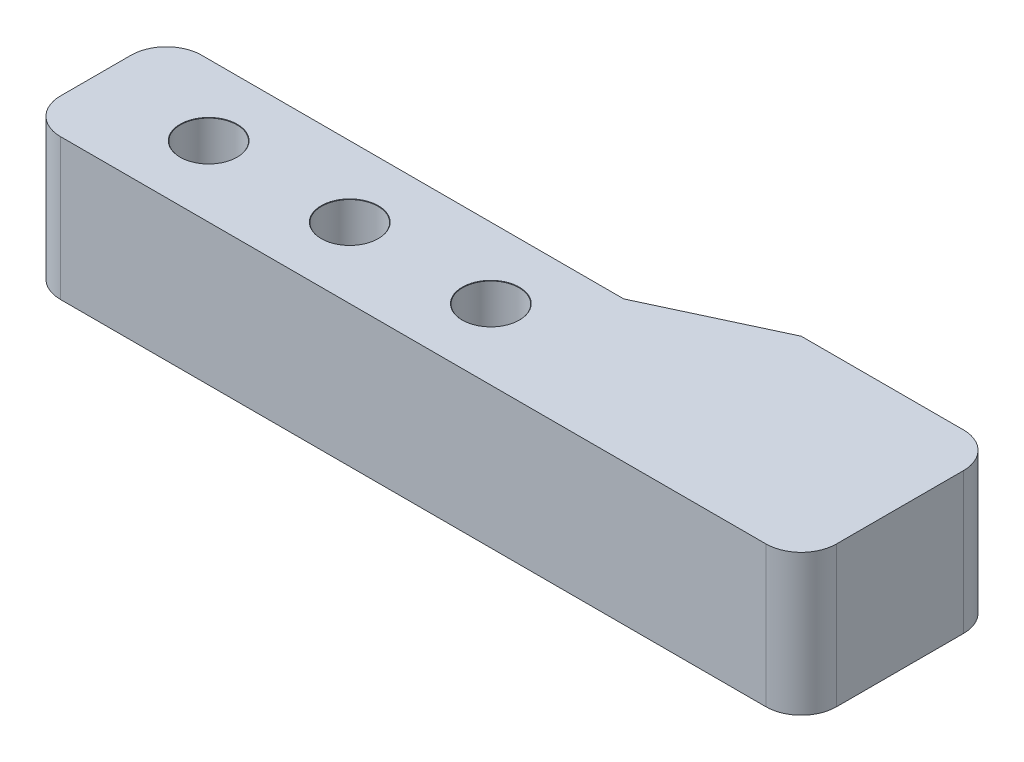
ISO-10303-21;
HEADER;
FILE_DESCRIPTION(('STEP AP214'),'2;1');
FILE_NAME('part.step','',(''),(''),'','','');
FILE_SCHEMA(('AUTOMOTIVE_DESIGN { 1 0 10303 214 1 1 1 1 }'));
ENDSEC;
DATA;
#1=APPLICATION_CONTEXT('core data for automotive mechanical design processes');
#2=APPLICATION_PROTOCOL_DEFINITION('international standard','automotive_design',2000,#1);
#3=PRODUCT_CONTEXT('',#1,'mechanical');
#4=PRODUCT('Part','Part','',(#3));
#5=PRODUCT_RELATED_PRODUCT_CATEGORY('part','',(#4));
#6=PRODUCT_DEFINITION_FORMATION('','',#4);
#7=PRODUCT_DEFINITION_CONTEXT('part definition',#1,'design');
#8=PRODUCT_DEFINITION('design','',#6,#7);
#9=PRODUCT_DEFINITION_SHAPE('','',#8);
#10=(LENGTH_UNIT() NAMED_UNIT(*) SI_UNIT(.MILLI.,.METRE.));
#11=(NAMED_UNIT(*) PLANE_ANGLE_UNIT() SI_UNIT($,.RADIAN.));
#12=(NAMED_UNIT(*) SI_UNIT($,.STERADIAN.) SOLID_ANGLE_UNIT());
#13=UNCERTAINTY_MEASURE_WITH_UNIT(LENGTH_MEASURE(1.E-05),#10,'distance_accuracy_value','');
#14=(GEOMETRIC_REPRESENTATION_CONTEXT(3) GLOBAL_UNCERTAINTY_ASSIGNED_CONTEXT((#13)) GLOBAL_UNIT_ASSIGNED_CONTEXT((#10,
#11,#12)) REPRESENTATION_CONTEXT('',''));
#15=CARTESIAN_POINT('',(0.,0.,0.));
#16=DIRECTION('',(0.,0.,1.));
#17=DIRECTION('',(1.,0.,0.));
#18=AXIS2_PLACEMENT_3D('',#15,#16,#17);
#19=CARTESIAN_POINT('',(28.,10.,0.));
#20=DIRECTION('',(0.,1.,0.));
#21=DIRECTION('',(0.,0.,1.));
#22=AXIS2_PLACEMENT_3D('',#19,#20,#21);
#23=CYLINDRICAL_SURFACE('',#22,2.);
#24=CARTESIAN_POINT('',(28.,9.975,0.));
#25=DIRECTION('',(0.,1.,0.));
#26=DIRECTION('',(0.,0.,1.));
#27=AXIS2_PLACEMENT_3D('',#24,#25,#26);
#28=CIRCLE('',#27,2.);
#29=CARTESIAN_POINT('',(28.,9.975,2.));
#30=VERTEX_POINT('',#29);
#31=EDGE_CURVE('E391',#30,#30,#28,.T.);
#32=ORIENTED_EDGE('',*,*,#31,.T.);
#33=EDGE_LOOP('',(#32));
#34=FACE_BOUND('',#33,.T.);
#35=CARTESIAN_POINT('',(28.,3.,0.));
#36=DIRECTION('',(0.,-1.,0.));
#37=DIRECTION('',(0.,0.,-1.));
#38=AXIS2_PLACEMENT_3D('',#35,#36,#37);
#39=CIRCLE('',#38,2.);
#40=CARTESIAN_POINT('',(28.,3.,-2.));
#41=VERTEX_POINT('',#40);
#42=EDGE_CURVE('E379',#41,#41,#39,.F.);
#43=ORIENTED_EDGE('',*,*,#42,.F.);
#44=EDGE_LOOP('',(#43));
#45=FACE_BOUND('',#44,.T.);
#46=ADVANCED_FACE('F33',(#34,#45),#23,.F.);
#47=CARTESIAN_POINT('',(18.,10.,0.));
#48=DIRECTION('',(0.,1.,0.));
#49=DIRECTION('',(0.,0.,1.));
#50=AXIS2_PLACEMENT_3D('',#47,#48,#49);
#51=CYLINDRICAL_SURFACE('',#50,2.);
#52=CARTESIAN_POINT('',(18.,9.975,0.));
#53=DIRECTION('',(0.,1.,0.));
#54=DIRECTION('',(0.,0.,1.));
#55=AXIS2_PLACEMENT_3D('',#52,#53,#54);
#56=CIRCLE('',#55,2.);
#57=CARTESIAN_POINT('',(18.,9.975,2.));
#58=VERTEX_POINT('',#57);
#59=EDGE_CURVE('E385',#58,#58,#56,.T.);
#60=ORIENTED_EDGE('',*,*,#59,.T.);
#61=EDGE_LOOP('',(#60));
#62=FACE_BOUND('',#61,.T.);
#63=CARTESIAN_POINT('',(18.,3.,0.));
#64=DIRECTION('',(0.,-1.,0.));
#65=DIRECTION('',(0.,0.,-1.));
#66=AXIS2_PLACEMENT_3D('',#63,#64,#65);
#67=CIRCLE('',#66,2.);
#68=CARTESIAN_POINT('',(18.,3.,-2.));
#69=VERTEX_POINT('',#68);
#70=EDGE_CURVE('E432',#69,#69,#67,.F.);
#71=ORIENTED_EDGE('',*,*,#70,.F.);
#72=EDGE_LOOP('',(#71));
#73=FACE_BOUND('',#72,.T.);
#74=ADVANCED_FACE('F516',(#62,#73),#51,.F.);
#75=CARTESIAN_POINT('',(8.,10.,0.));
#76=DIRECTION('',(0.,1.,0.));
#77=DIRECTION('',(0.,0.,1.));
#78=AXIS2_PLACEMENT_3D('',#75,#76,#77);
#79=CYLINDRICAL_SURFACE('',#78,2.);
#80=CARTESIAN_POINT('',(8.,9.975,0.));
#81=DIRECTION('',(0.,1.,0.));
#82=DIRECTION('',(0.,0.,1.));
#83=AXIS2_PLACEMENT_3D('',#80,#81,#82);
#84=CIRCLE('',#83,2.);
#85=CARTESIAN_POINT('',(8.,9.975,2.));
#86=VERTEX_POINT('',#85);
#87=EDGE_CURVE('E378',#86,#86,#84,.T.);
#88=ORIENTED_EDGE('',*,*,#87,.T.);
#89=EDGE_LOOP('',(#88));
#90=FACE_BOUND('',#89,.T.);
#91=CARTESIAN_POINT('',(8.,3.,0.));
#92=DIRECTION('',(0.,-1.,0.));
#93=DIRECTION('',(0.,0.,-1.));
#94=AXIS2_PLACEMENT_3D('',#91,#92,#93);
#95=CIRCLE('',#94,2.);
#96=CARTESIAN_POINT('',(8.,3.,-2.));
#97=VERTEX_POINT('',#96);
#98=EDGE_CURVE('E272',#97,#97,#95,.F.);
#99=ORIENTED_EDGE('',*,*,#98,.F.);
#100=EDGE_LOOP('',(#99));
#101=FACE_BOUND('',#100,.T.);
#102=ADVANCED_FACE('F522',(#90,#101),#79,.F.);
#103=CARTESIAN_POINT('',(32.4219723179618,10.,-5.));
#104=DIRECTION('',(0.,0.,1.));
#105=DIRECTION('',(1.,0.,0.));
#106=AXIS2_PLACEMENT_3D('',#103,#104,#105);
#107=PLANE('',#106);
#108=DIRECTION('',(-1.,0.,0.));
#109=VECTOR('',#108,1.);
#110=CARTESIAN_POINT('',(32.4219723179618,0.,-5.));
#111=LINE('',#110,#109);
#112=CARTESIAN_POINT('',(32.4219723179618,0.,-5.));
#113=VERTEX_POINT('',#112);
#114=CARTESIAN_POINT('',(2.5,0.,-5.));
#115=VERTEX_POINT('',#114);
#116=EDGE_CURVE('E394',#113,#115,#111,.T.);
#117=ORIENTED_EDGE('',*,*,#116,.T.);
#118=DIRECTION('',(0.,-1.,0.));
#119=VECTOR('',#118,1.);
#120=CARTESIAN_POINT('',(2.5,10.,-5.));
#121=LINE('',#120,#119);
#122=CARTESIAN_POINT('',(2.5,10.,-5.));
#123=VERTEX_POINT('',#122);
#124=EDGE_CURVE('E11',#115,#123,#121,.F.);
#125=ORIENTED_EDGE('',*,*,#124,.T.);
#126=DIRECTION('',(-1.,0.,0.));
#127=VECTOR('',#126,1.);
#128=CARTESIAN_POINT('',(32.4219723179618,10.,-5.));
#129=LINE('',#128,#127);
#130=CARTESIAN_POINT('',(32.4219723179618,10.,-5.));
#131=VERTEX_POINT('',#130);
#132=EDGE_CURVE('E395',#131,#123,#129,.T.);
#133=ORIENTED_EDGE('',*,*,#132,.F.);
#134=DIRECTION('',(0.,-1.,0.));
#135=VECTOR('',#134,1.);
#136=CARTESIAN_POINT('',(32.4219723179618,10.,-5.));
#137=LINE('',#136,#135);
#138=EDGE_CURVE('E410',#131,#113,#137,.T.);
#139=ORIENTED_EDGE('',*,*,#138,.T.);
#140=EDGE_LOOP('',(#117,#125,#133,#139));
#141=FACE_BOUND('',#140,.T.);
#142=ADVANCED_FACE('F506',(#141),#107,.F.);
#143=CARTESIAN_POINT('',(0.,10.,-5.));
#144=DIRECTION('',(1.,0.,0.));
#145=DIRECTION('',(0.,0.,-1.));
#146=AXIS2_PLACEMENT_3D('',#143,#144,#145);
#147=PLANE('',#146);
#148=DIRECTION('',(0.,0.,1.));
#149=VECTOR('',#148,1.);
#150=CARTESIAN_POINT('',(0.,10.,-5.));
#151=LINE('',#150,#149);
#152=CARTESIAN_POINT('',(0.,10.,-2.5));
#153=VERTEX_POINT('',#152);
#154=CARTESIAN_POINT('',(0.,10.,2.5));
#155=VERTEX_POINT('',#154);
#156=EDGE_CURVE('E398',#153,#155,#151,.T.);
#157=ORIENTED_EDGE('',*,*,#156,.F.);
#158=DIRECTION('',(0.,-1.,0.));
#159=VECTOR('',#158,1.);
#160=CARTESIAN_POINT('',(0.,10.,-2.5));
#161=LINE('',#160,#159);
#162=CARTESIAN_POINT('',(0.,0.,-2.5));
#163=VERTEX_POINT('',#162);
#164=EDGE_CURVE('E41',#153,#163,#161,.T.);
#165=ORIENTED_EDGE('',*,*,#164,.T.);
#166=DIRECTION('',(0.,0.,1.));
#167=VECTOR('',#166,1.);
#168=CARTESIAN_POINT('',(0.,0.,-5.));
#169=LINE('',#168,#167);
#170=CARTESIAN_POINT('',(0.,0.,2.5));
#171=VERTEX_POINT('',#170);
#172=EDGE_CURVE('E413',#163,#171,#169,.T.);
#173=ORIENTED_EDGE('',*,*,#172,.T.);
#174=DIRECTION('',(0.,-1.,0.));
#175=VECTOR('',#174,1.);
#176=CARTESIAN_POINT('',(0.,10.,2.5));
#177=LINE('',#176,#175);
#178=EDGE_CURVE('E463',#171,#155,#177,.F.);
#179=ORIENTED_EDGE('',*,*,#178,.T.);
#180=EDGE_LOOP('',(#157,#165,#173,#179));
#181=FACE_BOUND('',#180,.T.);
#182=ADVANCED_FACE('F469',(#181),#147,.F.);
#183=CARTESIAN_POINT('',(0.,10.,5.));
#184=DIRECTION('',(0.,0.,-1.));
#185=DIRECTION('',(-1.,0.,0.));
#186=AXIS2_PLACEMENT_3D('',#183,#184,#185);
#187=PLANE('',#186);
#188=DIRECTION('',(1.,0.,0.));
#189=VECTOR('',#188,1.);
#190=CARTESIAN_POINT('',(0.,0.,5.));
#191=LINE('',#190,#189);
#192=CARTESIAN_POINT('',(2.5,0.,5.));
#193=VERTEX_POINT('',#192);
#194=CARTESIAN_POINT('',(52.5,0.,5.));
#195=VERTEX_POINT('',#194);
#196=EDGE_CURVE('E416',#193,#195,#191,.T.);
#197=ORIENTED_EDGE('',*,*,#196,.T.);
#198=DIRECTION('',(0.,-1.,0.));
#199=VECTOR('',#198,1.);
#200=CARTESIAN_POINT('',(52.5,10.,5.));
#201=LINE('',#200,#199);
#202=CARTESIAN_POINT('',(52.5,10.,5.));
#203=VERTEX_POINT('',#202);
#204=EDGE_CURVE('E48',#195,#203,#201,.F.);
#205=ORIENTED_EDGE('',*,*,#204,.T.);
#206=DIRECTION('',(1.,0.,0.));
#207=VECTOR('',#206,1.);
#208=CARTESIAN_POINT('',(0.,10.,5.));
#209=LINE('',#208,#207);
#210=CARTESIAN_POINT('',(2.5,10.,5.));
#211=VERTEX_POINT('',#210);
#212=EDGE_CURVE('E401',#211,#203,#209,.T.);
#213=ORIENTED_EDGE('',*,*,#212,.F.);
#214=DIRECTION('',(0.,-1.,0.));
#215=VECTOR('',#214,1.);
#216=CARTESIAN_POINT('',(2.5,10.,5.));
#217=LINE('',#216,#215);
#218=EDGE_CURVE('E459',#211,#193,#217,.T.);
#219=ORIENTED_EDGE('',*,*,#218,.T.);
#220=EDGE_LOOP('',(#197,#205,#213,#219));
#221=FACE_BOUND('',#220,.T.);
#222=ADVANCED_FACE('F480',(#221),#187,.F.);
#223=CARTESIAN_POINT('',(55.,10.,5.));
#224=DIRECTION('',(-1.,0.,0.));
#225=DIRECTION('',(0.,0.,1.));
#226=AXIS2_PLACEMENT_3D('',#223,#224,#225);
#227=PLANE('',#226);
#228=DIRECTION('',(0.,0.,-1.));
#229=VECTOR('',#228,1.);
#230=CARTESIAN_POINT('',(55.,0.,5.));
#231=LINE('',#230,#229);
#232=CARTESIAN_POINT('',(55.,0.,2.5));
#233=VERTEX_POINT('',#232);
#234=CARTESIAN_POINT('',(55.,0.,-6.5));
#235=VERTEX_POINT('',#234);
#236=EDGE_CURVE('E418',#233,#235,#231,.T.);
#237=ORIENTED_EDGE('',*,*,#236,.T.);
#238=DIRECTION('',(0.,-1.,0.));
#239=VECTOR('',#238,1.);
#240=CARTESIAN_POINT('',(55.,10.,-6.5));
#241=LINE('',#240,#239);
#242=CARTESIAN_POINT('',(55.,10.,-6.5));
#243=VERTEX_POINT('',#242);
#244=EDGE_CURVE('E450',#235,#243,#241,.F.);
#245=ORIENTED_EDGE('',*,*,#244,.T.);
#246=DIRECTION('',(0.,0.,-1.));
#247=VECTOR('',#246,1.);
#248=CARTESIAN_POINT('',(55.,10.,5.));
#249=LINE('',#248,#247);
#250=CARTESIAN_POINT('',(55.,10.,2.5));
#251=VERTEX_POINT('',#250);
#252=EDGE_CURVE('E403',#251,#243,#249,.T.);
#253=ORIENTED_EDGE('',*,*,#252,.F.);
#254=DIRECTION('',(0.,-1.,0.));
#255=VECTOR('',#254,1.);
#256=CARTESIAN_POINT('',(55.,10.,2.5));
#257=LINE('',#256,#255);
#258=EDGE_CURVE('E447',#251,#233,#257,.T.);
#259=ORIENTED_EDGE('',*,*,#258,.T.);
#260=EDGE_LOOP('',(#237,#245,#253,#259));
#261=FACE_BOUND('',#260,.T.);
#262=ADVANCED_FACE('F489',(#261),#227,.F.);
#263=CARTESIAN_POINT('',(55.,10.,-9.));
#264=DIRECTION('',(0.,0.,1.));
#265=DIRECTION('',(1.,0.,0.));
#266=AXIS2_PLACEMENT_3D('',#263,#264,#265);
#267=PLANE('',#266);
#268=DIRECTION('',(-1.,0.,0.));
#269=VECTOR('',#268,1.);
#270=CARTESIAN_POINT('',(55.,10.,-9.));
#271=LINE('',#270,#269);
#272=CARTESIAN_POINT('',(52.5,10.,-9.));
#273=VERTEX_POINT('',#272);
#274=CARTESIAN_POINT('',(41.,10.,-8.99999999999999));
#275=VERTEX_POINT('',#274);
#276=EDGE_CURVE('E406',#273,#275,#271,.T.);
#277=ORIENTED_EDGE('',*,*,#276,.F.);
#278=DIRECTION('',(0.,-1.,0.));
#279=VECTOR('',#278,1.);
#280=CARTESIAN_POINT('',(52.5,10.,-9.));
#281=LINE('',#280,#279);
#282=CARTESIAN_POINT('',(52.5,0.,-9.));
#283=VERTEX_POINT('',#282);
#284=EDGE_CURVE('E429',#273,#283,#281,.T.);
#285=ORIENTED_EDGE('',*,*,#284,.T.);
#286=DIRECTION('',(-1.,0.,0.));
#287=VECTOR('',#286,1.);
#288=CARTESIAN_POINT('',(55.,0.,-9.));
#289=LINE('',#288,#287);
#290=CARTESIAN_POINT('',(41.,0.,-8.99999999999999));
#291=VERTEX_POINT('',#290);
#292=EDGE_CURVE('E421',#283,#291,#289,.T.);
#293=ORIENTED_EDGE('',*,*,#292,.T.);
#294=DIRECTION('',(0.,-1.,0.));
#295=VECTOR('',#294,1.);
#296=CARTESIAN_POINT('',(41.,10.,-8.99999999999999));
#297=LINE('',#296,#295);
#298=EDGE_CURVE('E426',#275,#291,#297,.T.);
#299=ORIENTED_EDGE('',*,*,#298,.F.);
#300=EDGE_LOOP('',(#277,#285,#293,#299));
#301=FACE_BOUND('',#300,.T.);
#302=ADVANCED_FACE('F498',(#301),#267,.F.);
#303=CARTESIAN_POINT('',(41.,10.,-8.99999999999999));
#304=DIRECTION('',(0.422618261740701,0.,0.906307787036649));
#305=DIRECTION('',(0.906307787036649,0.,-0.422618261740701));
#306=AXIS2_PLACEMENT_3D('',#303,#304,#305);
#307=PLANE('',#306);
#308=DIRECTION('',(-0.906307787036649,0.,0.422618261740701));
#309=VECTOR('',#308,1.);
#310=CARTESIAN_POINT('',(41.,0.,-8.99999999999999));
#311=LINE('',#310,#309);
#312=EDGE_CURVE('E399',#291,#113,#311,.T.);
#313=ORIENTED_EDGE('',*,*,#312,.T.);
#314=ORIENTED_EDGE('',*,*,#138,.F.);
#315=DIRECTION('',(-0.906307787036649,0.,0.422618261740701));
#316=VECTOR('',#315,1.);
#317=CARTESIAN_POINT('',(41.,10.,-8.99999999999999));
#318=LINE('',#317,#316);
#319=EDGE_CURVE('E408',#275,#131,#318,.T.);
#320=ORIENTED_EDGE('',*,*,#319,.F.);
#321=ORIENTED_EDGE('',*,*,#298,.T.);
#322=EDGE_LOOP('',(#313,#314,#320,#321));
#323=FACE_BOUND('',#322,.T.);
#324=ADVANCED_FACE('F504',(#323),#307,.F.);
#325=CARTESIAN_POINT('',(0.,10.,0.));
#326=DIRECTION('',(0.,1.,0.));
#327=DIRECTION('',(0.,0.,1.));
#328=AXIS2_PLACEMENT_3D('',#325,#326,#327);
#329=PLANE('',#328);
#330=CARTESIAN_POINT('',(8.,10.,0.));
#331=DIRECTION('',(0.,1.,0.));
#332=DIRECTION('',(0.,0.,1.));
#333=AXIS2_PLACEMENT_3D('',#330,#331,#332);
#334=CIRCLE('',#333,2.025);
#335=CARTESIAN_POINT('',(8.,10.,2.025));
#336=VERTEX_POINT('',#335);
#337=EDGE_CURVE('E375',#336,#336,#334,.T.);
#338=ORIENTED_EDGE('',*,*,#337,.F.);
#339=EDGE_LOOP('',(#338));
#340=FACE_BOUND('',#339,.T.);
#341=CARTESIAN_POINT('',(18.,10.,0.));
#342=DIRECTION('',(0.,1.,0.));
#343=DIRECTION('',(0.,0.,1.));
#344=AXIS2_PLACEMENT_3D('',#341,#342,#343);
#345=CIRCLE('',#344,2.025);
#346=CARTESIAN_POINT('',(18.,10.,2.025));
#347=VERTEX_POINT('',#346);
#348=EDGE_CURVE('E382',#347,#347,#345,.T.);
#349=ORIENTED_EDGE('',*,*,#348,.F.);
#350=EDGE_LOOP('',(#349));
#351=FACE_BOUND('',#350,.T.);
#352=CARTESIAN_POINT('',(28.,10.,0.));
#353=DIRECTION('',(0.,1.,0.));
#354=DIRECTION('',(0.,0.,1.));
#355=AXIS2_PLACEMENT_3D('',#352,#353,#354);
#356=CIRCLE('',#355,2.025);
#357=CARTESIAN_POINT('',(28.,10.,2.025));
#358=VERTEX_POINT('',#357);
#359=EDGE_CURVE('E388',#358,#358,#356,.T.);
#360=ORIENTED_EDGE('',*,*,#359,.F.);
#361=EDGE_LOOP('',(#360));
#362=FACE_BOUND('',#361,.T.);
#363=ORIENTED_EDGE('',*,*,#252,.T.);
#364=CARTESIAN_POINT('',(52.5,10.,-6.5));
#365=DIRECTION('',(0.,1.,0.));
#366=DIRECTION('',(0.,0.,1.));
#367=AXIS2_PLACEMENT_3D('',#364,#365,#366);
#368=CIRCLE('',#367,2.5);
#369=EDGE_CURVE('E457',#243,#273,#368,.T.);
#370=ORIENTED_EDGE('',*,*,#369,.T.);
#371=ORIENTED_EDGE('',*,*,#276,.T.);
#372=ORIENTED_EDGE('',*,*,#319,.T.);
#373=ORIENTED_EDGE('',*,*,#132,.T.);
#374=CARTESIAN_POINT('',(2.5,10.,-2.5));
#375=DIRECTION('',(0.,1.,0.));
#376=DIRECTION('',(0.,0.,1.));
#377=AXIS2_PLACEMENT_3D('',#374,#375,#376);
#378=CIRCLE('',#377,2.5);
#379=EDGE_CURVE('E453',#123,#153,#378,.T.);
#380=ORIENTED_EDGE('',*,*,#379,.T.);
#381=ORIENTED_EDGE('',*,*,#156,.T.);
#382=CARTESIAN_POINT('',(2.5,10.,2.5));
#383=DIRECTION('',(0.,1.,0.));
#384=DIRECTION('',(0.,0.,1.));
#385=AXIS2_PLACEMENT_3D('',#382,#383,#384);
#386=CIRCLE('',#385,2.5);
#387=EDGE_CURVE('E55',#155,#211,#386,.T.);
#388=ORIENTED_EDGE('',*,*,#387,.T.);
#389=ORIENTED_EDGE('',*,*,#212,.T.);
#390=CARTESIAN_POINT('',(52.5,10.,2.5));
#391=DIRECTION('',(0.,1.,0.));
#392=DIRECTION('',(0.,0.,1.));
#393=AXIS2_PLACEMENT_3D('',#390,#391,#392);
#394=CIRCLE('',#393,2.5);
#395=EDGE_CURVE('E455',#203,#251,#394,.T.);
#396=ORIENTED_EDGE('',*,*,#395,.T.);
#397=EDGE_LOOP('',(#363,#370,#371,#372,#373,#380,#381,#388,#389,#396));
#398=FACE_BOUND('',#397,.T.);
#399=ADVANCED_FACE('F482',(#340,#351,#362,#398),#329,.T.);
#400=CARTESIAN_POINT('',(0.,0.,0.));
#401=DIRECTION('',(0.,1.,0.));
#402=DIRECTION('',(0.,0.,1.));
#403=AXIS2_PLACEMENT_3D('',#400,#401,#402);
#404=PLANE('',#403);
#405=DIRECTION('',(0.5,0.,0.866025403784439));
#406=VECTOR('',#405,1.);
#407=CARTESIAN_POINT('',(9.75,0.,-3.03108891324554));
#408=LINE('',#407,#406);
#409=CARTESIAN_POINT('',(9.75,0.,-3.03108891324554));
#410=VERTEX_POINT('',#409);
#411=CARTESIAN_POINT('',(11.5,0.,0.));
#412=VERTEX_POINT('',#411);
#413=EDGE_CURVE('E259',#410,#412,#408,.T.);
#414=ORIENTED_EDGE('',*,*,#413,.F.);
#415=DIRECTION('',(1.,0.,0.));
#416=VECTOR('',#415,1.);
#417=CARTESIAN_POINT('',(6.25,0.,-3.03108891324554));
#418=LINE('',#417,#416);
#419=CARTESIAN_POINT('',(6.25,0.,-3.03108891324554));
#420=VERTEX_POINT('',#419);
#421=EDGE_CURVE('E226',#420,#410,#418,.T.);
#422=ORIENTED_EDGE('',*,*,#421,.F.);
#423=DIRECTION('',(0.5,0.,-0.866025403784439));
#424=VECTOR('',#423,1.);
#425=CARTESIAN_POINT('',(4.5,0.,0.));
#426=LINE('',#425,#424);
#427=CARTESIAN_POINT('',(4.5,0.,0.));
#428=VERTEX_POINT('',#427);
#429=EDGE_CURVE('E245',#428,#420,#426,.T.);
#430=ORIENTED_EDGE('',*,*,#429,.F.);
#431=DIRECTION('',(-0.5,0.,-0.866025403784439));
#432=VECTOR('',#431,1.);
#433=CARTESIAN_POINT('',(6.25,0.,3.03108891324554));
#434=LINE('',#433,#432);
#435=CARTESIAN_POINT('',(6.25,0.,3.03108891324554));
#436=VERTEX_POINT('',#435);
#437=EDGE_CURVE('E248',#436,#428,#434,.T.);
#438=ORIENTED_EDGE('',*,*,#437,.F.);
#439=DIRECTION('',(-1.,0.,0.));
#440=VECTOR('',#439,1.);
#441=CARTESIAN_POINT('',(9.75,0.,3.03108891324554));
#442=LINE('',#441,#440);
#443=CARTESIAN_POINT('',(9.75,0.,3.03108891324554));
#444=VERTEX_POINT('',#443);
#445=EDGE_CURVE('E265',#444,#436,#442,.T.);
#446=ORIENTED_EDGE('',*,*,#445,.F.);
#447=DIRECTION('',(-0.5,0.,0.866025403784439));
#448=VECTOR('',#447,1.);
#449=CARTESIAN_POINT('',(11.5,0.,0.));
#450=LINE('',#449,#448);
#451=EDGE_CURVE('E262',#412,#444,#450,.T.);
#452=ORIENTED_EDGE('',*,*,#451,.F.);
#453=EDGE_LOOP('',(#414,#422,#430,#438,#446,#452));
#454=FACE_BOUND('',#453,.T.);
#455=DIRECTION('',(-0.5,0.,0.866025403784439));
#456=VECTOR('',#455,1.);
#457=CARTESIAN_POINT('',(21.5,0.,0.));
#458=LINE('',#457,#456);
#459=CARTESIAN_POINT('',(21.5,0.,0.));
#460=VERTEX_POINT('',#459);
#461=CARTESIAN_POINT('',(19.75,0.,3.03108891324554));
#462=VERTEX_POINT('',#461);
#463=EDGE_CURVE('E302',#460,#462,#458,.T.);
#464=ORIENTED_EDGE('',*,*,#463,.F.);
#465=DIRECTION('',(0.5,0.,0.866025403784439));
#466=VECTOR('',#465,1.);
#467=CARTESIAN_POINT('',(19.75,0.,-3.03108891324554));
#468=LINE('',#467,#466);
#469=CARTESIAN_POINT('',(19.75,0.,-3.03108891324554));
#470=VERTEX_POINT('',#469);
#471=EDGE_CURVE('E300',#470,#460,#468,.T.);
#472=ORIENTED_EDGE('',*,*,#471,.F.);
#473=DIRECTION('',(1.,0.,0.));
#474=VECTOR('',#473,1.);
#475=CARTESIAN_POINT('',(16.25,0.,-3.03108891324554));
#476=LINE('',#475,#474);
#477=CARTESIAN_POINT('',(16.25,0.,-3.03108891324554));
#478=VERTEX_POINT('',#477);
#479=EDGE_CURVE('E284',#478,#470,#476,.T.);
#480=ORIENTED_EDGE('',*,*,#479,.F.);
#481=DIRECTION('',(0.5,0.,-0.866025403784438));
#482=VECTOR('',#481,1.);
#483=CARTESIAN_POINT('',(14.5,0.,0.));
#484=LINE('',#483,#482);
#485=CARTESIAN_POINT('',(14.5,0.,0.));
#486=VERTEX_POINT('',#485);
#487=EDGE_CURVE('E312',#486,#478,#484,.T.);
#488=ORIENTED_EDGE('',*,*,#487,.F.);
#489=DIRECTION('',(-0.5,0.,-0.866025403784439));
#490=VECTOR('',#489,1.);
#491=CARTESIAN_POINT('',(16.25,0.,3.03108891324554));
#492=LINE('',#491,#490);
#493=CARTESIAN_POINT('',(16.25,0.,3.03108891324554));
#494=VERTEX_POINT('',#493);
#495=EDGE_CURVE('E309',#494,#486,#492,.T.);
#496=ORIENTED_EDGE('',*,*,#495,.F.);
#497=DIRECTION('',(-1.,0.,0.));
#498=VECTOR('',#497,1.);
#499=CARTESIAN_POINT('',(19.75,0.,3.03108891324554));
#500=LINE('',#499,#498);
#501=EDGE_CURVE('E306',#462,#494,#500,.T.);
#502=ORIENTED_EDGE('',*,*,#501,.F.);
#503=EDGE_LOOP('',(#464,#472,#480,#488,#496,#502));
#504=FACE_BOUND('',#503,.T.);
#505=DIRECTION('',(-0.500000000000001,0.,0.866025403784438));
#506=VECTOR('',#505,1.);
#507=CARTESIAN_POINT('',(31.5,0.,0.));
#508=LINE('',#507,#506);
#509=CARTESIAN_POINT('',(31.5,0.,0.));
#510=VERTEX_POINT('',#509);
#511=CARTESIAN_POINT('',(29.75,0.,3.03108891324554));
#512=VERTEX_POINT('',#511);
#513=EDGE_CURVE('E350',#510,#512,#508,.T.);
#514=ORIENTED_EDGE('',*,*,#513,.F.);
#515=DIRECTION('',(0.5,0.,0.866025403784439));
#516=VECTOR('',#515,1.);
#517=CARTESIAN_POINT('',(29.75,0.,-3.03108891324554));
#518=LINE('',#517,#516);
#519=CARTESIAN_POINT('',(29.75,0.,-3.03108891324554));
#520=VERTEX_POINT('',#519);
#521=EDGE_CURVE('E348',#520,#510,#518,.T.);
#522=ORIENTED_EDGE('',*,*,#521,.F.);
#523=DIRECTION('',(1.,0.,0.));
#524=VECTOR('',#523,1.);
#525=CARTESIAN_POINT('',(26.25,0.,-3.03108891324554));
#526=LINE('',#525,#524);
#527=CARTESIAN_POINT('',(26.25,0.,-3.03108891324554));
#528=VERTEX_POINT('',#527);
#529=EDGE_CURVE('E332',#528,#520,#526,.T.);
#530=ORIENTED_EDGE('',*,*,#529,.F.);
#531=DIRECTION('',(0.5,0.,-0.866025403784439));
#532=VECTOR('',#531,1.);
#533=CARTESIAN_POINT('',(24.5,0.,0.));
#534=LINE('',#533,#532);
#535=CARTESIAN_POINT('',(24.5,0.,0.));
#536=VERTEX_POINT('',#535);
#537=EDGE_CURVE('E359',#536,#528,#534,.T.);
#538=ORIENTED_EDGE('',*,*,#537,.F.);
#539=DIRECTION('',(-0.5,0.,-0.866025403784438));
#540=VECTOR('',#539,1.);
#541=CARTESIAN_POINT('',(26.25,0.,3.03108891324554));
#542=LINE('',#541,#540);
#543=CARTESIAN_POINT('',(26.25,0.,3.03108891324554));
#544=VERTEX_POINT('',#543);
#545=EDGE_CURVE('E356',#544,#536,#542,.T.);
#546=ORIENTED_EDGE('',*,*,#545,.F.);
#547=DIRECTION('',(-1.,0.,0.));
#548=VECTOR('',#547,1.);
#549=CARTESIAN_POINT('',(29.75,0.,3.03108891324554));
#550=LINE('',#549,#548);
#551=EDGE_CURVE('E353',#512,#544,#550,.T.);
#552=ORIENTED_EDGE('',*,*,#551,.F.);
#553=EDGE_LOOP('',(#514,#522,#530,#538,#546,#552));
#554=FACE_BOUND('',#553,.T.);
#555=ORIENTED_EDGE('',*,*,#292,.F.);
#556=CARTESIAN_POINT('',(52.5,0.,-6.5));
#557=DIRECTION('',(0.,1.,0.));
#558=DIRECTION('',(0.,0.,1.));
#559=AXIS2_PLACEMENT_3D('',#556,#557,#558);
#560=CIRCLE('',#559,2.5);
#561=EDGE_CURVE('E445',#283,#235,#560,.F.);
#562=ORIENTED_EDGE('',*,*,#561,.T.);
#563=ORIENTED_EDGE('',*,*,#236,.F.);
#564=CARTESIAN_POINT('',(52.5,0.,2.5));
#565=DIRECTION('',(0.,1.,0.));
#566=DIRECTION('',(0.,0.,1.));
#567=AXIS2_PLACEMENT_3D('',#564,#565,#566);
#568=CIRCLE('',#567,2.5);
#569=EDGE_CURVE('E443',#233,#195,#568,.F.);
#570=ORIENTED_EDGE('',*,*,#569,.T.);
#571=ORIENTED_EDGE('',*,*,#196,.F.);
#572=CARTESIAN_POINT('',(2.5,0.,2.5));
#573=DIRECTION('',(0.,1.,0.));
#574=DIRECTION('',(0.,0.,1.));
#575=AXIS2_PLACEMENT_3D('',#572,#573,#574);
#576=CIRCLE('',#575,2.5);
#577=EDGE_CURVE('E439',#193,#171,#576,.F.);
#578=ORIENTED_EDGE('',*,*,#577,.T.);
#579=ORIENTED_EDGE('',*,*,#172,.F.);
#580=CARTESIAN_POINT('',(2.5,0.,-2.5));
#581=DIRECTION('',(0.,1.,0.));
#582=DIRECTION('',(0.,0.,1.));
#583=AXIS2_PLACEMENT_3D('',#580,#581,#582);
#584=CIRCLE('',#583,2.5);
#585=EDGE_CURVE('E441',#163,#115,#584,.F.);
#586=ORIENTED_EDGE('',*,*,#585,.T.);
#587=ORIENTED_EDGE('',*,*,#116,.F.);
#588=ORIENTED_EDGE('',*,*,#312,.F.);
#589=EDGE_LOOP('',(#555,#562,#563,#570,#571,#578,#579,#586,#587,#588));
#590=FACE_BOUND('',#589,.T.);
#591=ADVANCED_FACE('F475',(#454,#504,#554,#590),#404,.F.);
#592=CARTESIAN_POINT('',(28.,10.,0.));
#593=DIRECTION('',(0.,1.,0.));
#594=DIRECTION('',(0.,0.,1.));
#595=AXIS2_PLACEMENT_3D('',#592,#593,#594);
#596=CONICAL_SURFACE('',#595,2.025,0.785398163397483);
#597=ORIENTED_EDGE('',*,*,#31,.F.);
#598=EDGE_LOOP('',(#597));
#599=FACE_BOUND('',#598,.T.);
#600=ORIENTED_EDGE('',*,*,#359,.T.);
#601=EDGE_LOOP('',(#600));
#602=FACE_BOUND('',#601,.T.);
#603=ADVANCED_FACE('F528',(#599,#602),#596,.F.);
#604=CARTESIAN_POINT('',(18.,10.,0.));
#605=DIRECTION('',(0.,1.,0.));
#606=DIRECTION('',(0.,0.,1.));
#607=AXIS2_PLACEMENT_3D('',#604,#605,#606);
#608=CONICAL_SURFACE('',#607,2.025,0.785398163397483);
#609=ORIENTED_EDGE('',*,*,#59,.F.);
#610=EDGE_LOOP('',(#609));
#611=FACE_BOUND('',#610,.T.);
#612=ORIENTED_EDGE('',*,*,#348,.T.);
#613=EDGE_LOOP('',(#612));
#614=FACE_BOUND('',#613,.T.);
#615=ADVANCED_FACE('F572',(#611,#614),#608,.F.);
#616=CARTESIAN_POINT('',(8.,10.,0.));
#617=DIRECTION('',(0.,1.,0.));
#618=DIRECTION('',(0.,0.,1.));
#619=AXIS2_PLACEMENT_3D('',#616,#617,#618);
#620=CONICAL_SURFACE('',#619,2.025,0.785398163397483);
#621=ORIENTED_EDGE('',*,*,#87,.F.);
#622=EDGE_LOOP('',(#621));
#623=FACE_BOUND('',#622,.T.);
#624=ORIENTED_EDGE('',*,*,#337,.T.);
#625=EDGE_LOOP('',(#624));
#626=FACE_BOUND('',#625,.T.);
#627=ADVANCED_FACE('F569',(#623,#626),#620,.F.);
#628=CARTESIAN_POINT('',(0.,3.,0.));
#629=DIRECTION('',(0.,-1.,0.));
#630=DIRECTION('',(0.,0.,-1.));
#631=AXIS2_PLACEMENT_3D('',#628,#629,#630);
#632=PLANE('',#631);
#633=DIRECTION('',(1.,0.,0.));
#634=VECTOR('',#633,1.);
#635=CARTESIAN_POINT('',(6.25,3.,-3.03108891324554));
#636=LINE('',#635,#634);
#637=CARTESIAN_POINT('',(6.25,3.,-3.03108891324554));
#638=VERTEX_POINT('',#637);
#639=CARTESIAN_POINT('',(9.75,3.,-3.03108891324554));
#640=VERTEX_POINT('',#639);
#641=EDGE_CURVE('E223',#638,#640,#636,.T.);
#642=ORIENTED_EDGE('',*,*,#641,.T.);
#643=DIRECTION('',(0.5,0.,0.866025403784439));
#644=VECTOR('',#643,1.);
#645=CARTESIAN_POINT('',(9.75,3.,-3.03108891324554));
#646=LINE('',#645,#644);
#647=CARTESIAN_POINT('',(11.5,3.,0.));
#648=VERTEX_POINT('',#647);
#649=EDGE_CURVE('E234',#640,#648,#646,.T.);
#650=ORIENTED_EDGE('',*,*,#649,.T.);
#651=DIRECTION('',(-0.5,0.,0.866025403784439));
#652=VECTOR('',#651,1.);
#653=CARTESIAN_POINT('',(11.5,3.,0.));
#654=LINE('',#653,#652);
#655=CARTESIAN_POINT('',(9.75,3.,3.03108891324554));
#656=VERTEX_POINT('',#655);
#657=EDGE_CURVE('E239',#648,#656,#654,.T.);
#658=ORIENTED_EDGE('',*,*,#657,.T.);
#659=DIRECTION('',(-1.,0.,0.));
#660=VECTOR('',#659,1.);
#661=CARTESIAN_POINT('',(9.75,3.,3.03108891324554));
#662=LINE('',#661,#660);
#663=CARTESIAN_POINT('',(6.25,3.,3.03108891324554));
#664=VERTEX_POINT('',#663);
#665=EDGE_CURVE('E252',#656,#664,#662,.T.);
#666=ORIENTED_EDGE('',*,*,#665,.T.);
#667=DIRECTION('',(-0.5,0.,-0.866025403784439));
#668=VECTOR('',#667,1.);
#669=CARTESIAN_POINT('',(6.25,3.,3.03108891324554));
#670=LINE('',#669,#668);
#671=CARTESIAN_POINT('',(4.5,3.,0.));
#672=VERTEX_POINT('',#671);
#673=EDGE_CURVE('E255',#664,#672,#670,.T.);
#674=ORIENTED_EDGE('',*,*,#673,.T.);
#675=DIRECTION('',(0.5,0.,-0.866025403784439));
#676=VECTOR('',#675,1.);
#677=CARTESIAN_POINT('',(4.5,3.,0.));
#678=LINE('',#677,#676);
#679=EDGE_CURVE('E231',#672,#638,#678,.T.);
#680=ORIENTED_EDGE('',*,*,#679,.T.);
#681=EDGE_LOOP('',(#642,#650,#658,#666,#674,#680));
#682=FACE_BOUND('',#681,.T.);
#683=ORIENTED_EDGE('',*,*,#98,.T.);
#684=EDGE_LOOP('',(#683));
#685=FACE_BOUND('',#684,.T.);
#686=ADVANCED_FACE('F241',(#682,#685),#632,.T.);
#687=CARTESIAN_POINT('',(6.25,3.,-3.03108891324554));
#688=DIRECTION('',(0.,0.,-1.));
#689=DIRECTION('',(-1.,0.,0.));
#690=AXIS2_PLACEMENT_3D('',#687,#688,#689);
#691=PLANE('',#690);
#692=ORIENTED_EDGE('',*,*,#421,.T.);
#693=DIRECTION('',(0.,-1.,0.));
#694=VECTOR('',#693,1.);
#695=CARTESIAN_POINT('',(9.75,3.,-3.03108891324554));
#696=LINE('',#695,#694);
#697=EDGE_CURVE('E219',#640,#410,#696,.T.);
#698=ORIENTED_EDGE('',*,*,#697,.F.);
#699=ORIENTED_EDGE('',*,*,#641,.F.);
#700=DIRECTION('',(0.,-1.,0.));
#701=VECTOR('',#700,1.);
#702=CARTESIAN_POINT('',(6.25,3.,-3.03108891324554));
#703=LINE('',#702,#701);
#704=EDGE_CURVE('E270',#638,#420,#703,.T.);
#705=ORIENTED_EDGE('',*,*,#704,.T.);
#706=EDGE_LOOP('',(#692,#698,#699,#705));
#707=FACE_BOUND('',#706,.T.);
#708=ADVANCED_FACE('F221',(#707),#691,.F.);
#709=CARTESIAN_POINT('',(4.5,3.,0.));
#710=DIRECTION('',(-0.866025403784439,0.,-0.5));
#711=DIRECTION('',(-0.5,0.,0.866025403784439));
#712=AXIS2_PLACEMENT_3D('',#709,#710,#711);
#713=PLANE('',#712);
#714=ORIENTED_EDGE('',*,*,#429,.T.);
#715=ORIENTED_EDGE('',*,*,#704,.F.);
#716=ORIENTED_EDGE('',*,*,#679,.F.);
#717=DIRECTION('',(0.,-1.,0.));
#718=VECTOR('',#717,1.);
#719=CARTESIAN_POINT('',(4.5,3.,0.));
#720=LINE('',#719,#718);
#721=EDGE_CURVE('E273',#672,#428,#720,.T.);
#722=ORIENTED_EDGE('',*,*,#721,.T.);
#723=EDGE_LOOP('',(#714,#715,#716,#722));
#724=FACE_BOUND('',#723,.T.);
#725=ADVANCED_FACE('F780',(#724),#713,.F.);
#726=CARTESIAN_POINT('',(6.25,3.,3.03108891324554));
#727=DIRECTION('',(-0.866025403784439,0.,0.5));
#728=DIRECTION('',(0.5,0.,0.866025403784439));
#729=AXIS2_PLACEMENT_3D('',#726,#727,#728);
#730=PLANE('',#729);
#731=ORIENTED_EDGE('',*,*,#437,.T.);
#732=ORIENTED_EDGE('',*,*,#721,.F.);
#733=ORIENTED_EDGE('',*,*,#673,.F.);
#734=DIRECTION('',(0.,-1.,0.));
#735=VECTOR('',#734,1.);
#736=CARTESIAN_POINT('',(6.25,3.,3.03108891324554));
#737=LINE('',#736,#735);
#738=EDGE_CURVE('E275',#664,#436,#737,.T.);
#739=ORIENTED_EDGE('',*,*,#738,.T.);
#740=EDGE_LOOP('',(#731,#732,#733,#739));
#741=FACE_BOUND('',#740,.T.);
#742=ADVANCED_FACE('F788',(#741),#730,.F.);
#743=CARTESIAN_POINT('',(9.75,3.,3.03108891324554));
#744=DIRECTION('',(0.,0.,1.));
#745=DIRECTION('',(1.,0.,0.));
#746=AXIS2_PLACEMENT_3D('',#743,#744,#745);
#747=PLANE('',#746);
#748=ORIENTED_EDGE('',*,*,#445,.T.);
#749=ORIENTED_EDGE('',*,*,#738,.F.);
#750=ORIENTED_EDGE('',*,*,#665,.F.);
#751=DIRECTION('',(0.,-1.,0.));
#752=VECTOR('',#751,1.);
#753=CARTESIAN_POINT('',(9.75,3.,3.03108891324554));
#754=LINE('',#753,#752);
#755=EDGE_CURVE('E277',#656,#444,#754,.T.);
#756=ORIENTED_EDGE('',*,*,#755,.T.);
#757=EDGE_LOOP('',(#748,#749,#750,#756));
#758=FACE_BOUND('',#757,.T.);
#759=ADVANCED_FACE('F798',(#758),#747,.F.);
#760=CARTESIAN_POINT('',(11.5,3.,0.));
#761=DIRECTION('',(0.866025403784438,0.,0.5));
#762=DIRECTION('',(0.5,0.,-0.866025403784439));
#763=AXIS2_PLACEMENT_3D('',#760,#761,#762);
#764=PLANE('',#763);
#765=ORIENTED_EDGE('',*,*,#451,.T.);
#766=ORIENTED_EDGE('',*,*,#755,.F.);
#767=ORIENTED_EDGE('',*,*,#657,.F.);
#768=DIRECTION('',(0.,-1.,0.));
#769=VECTOR('',#768,1.);
#770=CARTESIAN_POINT('',(11.5,3.,0.));
#771=LINE('',#770,#769);
#772=EDGE_CURVE('E230',#648,#412,#771,.T.);
#773=ORIENTED_EDGE('',*,*,#772,.T.);
#774=EDGE_LOOP('',(#765,#766,#767,#773));
#775=FACE_BOUND('',#774,.T.);
#776=ADVANCED_FACE('F605',(#775),#764,.F.);
#777=CARTESIAN_POINT('',(9.75,3.,-3.03108891324554));
#778=DIRECTION('',(0.866025403784438,0.,-0.5));
#779=DIRECTION('',(-0.5,0.,-0.866025403784439));
#780=AXIS2_PLACEMENT_3D('',#777,#778,#779);
#781=PLANE('',#780);
#782=ORIENTED_EDGE('',*,*,#413,.T.);
#783=ORIENTED_EDGE('',*,*,#772,.F.);
#784=ORIENTED_EDGE('',*,*,#649,.F.);
#785=ORIENTED_EDGE('',*,*,#697,.T.);
#786=EDGE_LOOP('',(#782,#783,#784,#785));
#787=FACE_BOUND('',#786,.T.);
#788=ADVANCED_FACE('F235',(#787),#781,.F.);
#789=CARTESIAN_POINT('',(0.,3.,0.));
#790=DIRECTION('',(0.,-1.,0.));
#791=DIRECTION('',(0.,0.,-1.));
#792=AXIS2_PLACEMENT_3D('',#789,#790,#791);
#793=PLANE('',#792);
#794=DIRECTION('',(0.5,0.,0.866025403784439));
#795=VECTOR('',#794,1.);
#796=CARTESIAN_POINT('',(19.75,3.,-3.03108891324554));
#797=LINE('',#796,#795);
#798=CARTESIAN_POINT('',(19.75,3.,-3.03108891324554));
#799=VERTEX_POINT('',#798);
#800=CARTESIAN_POINT('',(21.5,3.,0.));
#801=VERTEX_POINT('',#800);
#802=EDGE_CURVE('E280',#799,#801,#797,.T.);
#803=ORIENTED_EDGE('',*,*,#802,.T.);
#804=DIRECTION('',(-0.5,0.,0.866025403784439));
#805=VECTOR('',#804,1.);
#806=CARTESIAN_POINT('',(21.5,3.,0.));
#807=LINE('',#806,#805);
#808=CARTESIAN_POINT('',(19.75,3.,3.03108891324554));
#809=VERTEX_POINT('',#808);
#810=EDGE_CURVE('E283',#801,#809,#807,.T.);
#811=ORIENTED_EDGE('',*,*,#810,.T.);
#812=DIRECTION('',(-1.,0.,0.));
#813=VECTOR('',#812,1.);
#814=CARTESIAN_POINT('',(19.75,3.,3.03108891324554));
#815=LINE('',#814,#813);
#816=CARTESIAN_POINT('',(16.25,3.,3.03108891324554));
#817=VERTEX_POINT('',#816);
#818=EDGE_CURVE('E287',#809,#817,#815,.T.);
#819=ORIENTED_EDGE('',*,*,#818,.T.);
#820=DIRECTION('',(-0.5,0.,-0.866025403784439));
#821=VECTOR('',#820,1.);
#822=CARTESIAN_POINT('',(16.25,3.,3.03108891324554));
#823=LINE('',#822,#821);
#824=CARTESIAN_POINT('',(14.5,3.,0.));
#825=VERTEX_POINT('',#824);
#826=EDGE_CURVE('E290',#817,#825,#823,.T.);
#827=ORIENTED_EDGE('',*,*,#826,.T.);
#828=DIRECTION('',(0.5,0.,-0.866025403784438));
#829=VECTOR('',#828,1.);
#830=CARTESIAN_POINT('',(14.5,3.,0.));
#831=LINE('',#830,#829);
#832=CARTESIAN_POINT('',(16.25,3.,-3.03108891324554));
#833=VERTEX_POINT('',#832);
#834=EDGE_CURVE('E293',#825,#833,#831,.T.);
#835=ORIENTED_EDGE('',*,*,#834,.T.);
#836=DIRECTION('',(1.,0.,0.));
#837=VECTOR('',#836,1.);
#838=CARTESIAN_POINT('',(16.25,3.,-3.03108891324554));
#839=LINE('',#838,#837);
#840=EDGE_CURVE('E296',#833,#799,#839,.T.);
#841=ORIENTED_EDGE('',*,*,#840,.T.);
#842=EDGE_LOOP('',(#803,#811,#819,#827,#835,#841));
#843=FACE_BOUND('',#842,.T.);
#844=ORIENTED_EDGE('',*,*,#70,.T.);
#845=EDGE_LOOP('',(#844));
#846=FACE_BOUND('',#845,.T.);
#847=ADVANCED_FACE('F593',(#843,#846),#793,.T.);
#848=CARTESIAN_POINT('',(19.75,3.,-3.03108891324554));
#849=DIRECTION('',(0.866025403784438,0.,-0.5));
#850=DIRECTION('',(-0.5,0.,-0.866025403784439));
#851=AXIS2_PLACEMENT_3D('',#848,#849,#850);
#852=PLANE('',#851);
#853=ORIENTED_EDGE('',*,*,#471,.T.);
#854=DIRECTION('',(0.,-1.,0.));
#855=VECTOR('',#854,1.);
#856=CARTESIAN_POINT('',(21.5,3.,0.));
#857=LINE('',#856,#855);
#858=EDGE_CURVE('E299',#801,#460,#857,.T.);
#859=ORIENTED_EDGE('',*,*,#858,.F.);
#860=ORIENTED_EDGE('',*,*,#802,.F.);
#861=DIRECTION('',(0.,-1.,0.));
#862=VECTOR('',#861,1.);
#863=CARTESIAN_POINT('',(19.75,3.,-3.03108891324554));
#864=LINE('',#863,#862);
#865=EDGE_CURVE('E260',#799,#470,#864,.T.);
#866=ORIENTED_EDGE('',*,*,#865,.T.);
#867=EDGE_LOOP('',(#853,#859,#860,#866));
#868=FACE_BOUND('',#867,.T.);
#869=ADVANCED_FACE('F595',(#868),#852,.F.);
#870=CARTESIAN_POINT('',(16.25,3.,-3.03108891324554));
#871=DIRECTION('',(0.,0.,-1.));
#872=DIRECTION('',(-1.,0.,0.));
#873=AXIS2_PLACEMENT_3D('',#870,#871,#872);
#874=PLANE('',#873);
#875=ORIENTED_EDGE('',*,*,#479,.T.);
#876=ORIENTED_EDGE('',*,*,#865,.F.);
#877=ORIENTED_EDGE('',*,*,#840,.F.);
#878=DIRECTION('',(0.,-1.,0.));
#879=VECTOR('',#878,1.);
#880=CARTESIAN_POINT('',(16.25,3.,-3.03108891324554));
#881=LINE('',#880,#879);
#882=EDGE_CURVE('E318',#833,#478,#881,.T.);
#883=ORIENTED_EDGE('',*,*,#882,.T.);
#884=EDGE_LOOP('',(#875,#876,#877,#883));
#885=FACE_BOUND('',#884,.T.);
#886=ADVANCED_FACE('F602',(#885),#874,.F.);
#887=CARTESIAN_POINT('',(14.5,3.,0.));
#888=DIRECTION('',(-0.866025403784438,0.,-0.5));
#889=DIRECTION('',(-0.5,0.,0.866025403784439));
#890=AXIS2_PLACEMENT_3D('',#887,#888,#889);
#891=PLANE('',#890);
#892=ORIENTED_EDGE('',*,*,#487,.T.);
#893=ORIENTED_EDGE('',*,*,#882,.F.);
#894=ORIENTED_EDGE('',*,*,#834,.F.);
#895=DIRECTION('',(0.,-1.,0.));
#896=VECTOR('',#895,1.);
#897=CARTESIAN_POINT('',(14.5,3.,0.));
#898=LINE('',#897,#896);
#899=EDGE_CURVE('E320',#825,#486,#898,.T.);
#900=ORIENTED_EDGE('',*,*,#899,.T.);
#901=EDGE_LOOP('',(#892,#893,#894,#900));
#902=FACE_BOUND('',#901,.T.);
#903=ADVANCED_FACE('F611',(#902),#891,.F.);
#904=CARTESIAN_POINT('',(16.25,3.,3.03108891324554));
#905=DIRECTION('',(-0.866025403784439,0.,0.5));
#906=DIRECTION('',(0.5,0.,0.866025403784439));
#907=AXIS2_PLACEMENT_3D('',#904,#905,#906);
#908=PLANE('',#907);
#909=ORIENTED_EDGE('',*,*,#495,.T.);
#910=ORIENTED_EDGE('',*,*,#899,.F.);
#911=ORIENTED_EDGE('',*,*,#826,.F.);
#912=DIRECTION('',(0.,-1.,0.));
#913=VECTOR('',#912,1.);
#914=CARTESIAN_POINT('',(16.25,3.,3.03108891324554));
#915=LINE('',#914,#913);
#916=EDGE_CURVE('E322',#817,#494,#915,.T.);
#917=ORIENTED_EDGE('',*,*,#916,.T.);
#918=EDGE_LOOP('',(#909,#910,#911,#917));
#919=FACE_BOUND('',#918,.T.);
#920=ADVANCED_FACE('F615',(#919),#908,.F.);
#921=CARTESIAN_POINT('',(19.75,3.,3.03108891324554));
#922=DIRECTION('',(0.,0.,1.));
#923=DIRECTION('',(1.,0.,0.));
#924=AXIS2_PLACEMENT_3D('',#921,#922,#923);
#925=PLANE('',#924);
#926=ORIENTED_EDGE('',*,*,#501,.T.);
#927=ORIENTED_EDGE('',*,*,#916,.F.);
#928=ORIENTED_EDGE('',*,*,#818,.F.);
#929=DIRECTION('',(0.,-1.,0.));
#930=VECTOR('',#929,1.);
#931=CARTESIAN_POINT('',(19.75,3.,3.03108891324554));
#932=LINE('',#931,#930);
#933=EDGE_CURVE('E324',#809,#462,#932,.T.);
#934=ORIENTED_EDGE('',*,*,#933,.T.);
#935=EDGE_LOOP('',(#926,#927,#928,#934));
#936=FACE_BOUND('',#935,.T.);
#937=ADVANCED_FACE('F619',(#936),#925,.F.);
#938=CARTESIAN_POINT('',(21.5,3.,0.));
#939=DIRECTION('',(0.866025403784439,0.,0.5));
#940=DIRECTION('',(0.5,0.,-0.866025403784439));
#941=AXIS2_PLACEMENT_3D('',#938,#939,#940);
#942=PLANE('',#941);
#943=ORIENTED_EDGE('',*,*,#463,.T.);
#944=ORIENTED_EDGE('',*,*,#933,.F.);
#945=ORIENTED_EDGE('',*,*,#810,.F.);
#946=ORIENTED_EDGE('',*,*,#858,.T.);
#947=EDGE_LOOP('',(#943,#944,#945,#946));
#948=FACE_BOUND('',#947,.T.);
#949=ADVANCED_FACE('F623',(#948),#942,.F.);
#950=CARTESIAN_POINT('',(0.,3.,0.));
#951=DIRECTION('',(0.,-1.,0.));
#952=DIRECTION('',(0.,0.,-1.));
#953=AXIS2_PLACEMENT_3D('',#950,#951,#952);
#954=PLANE('',#953);
#955=DIRECTION('',(0.5,0.,0.866025403784439));
#956=VECTOR('',#955,1.);
#957=CARTESIAN_POINT('',(29.75,3.,-3.03108891324554));
#958=LINE('',#957,#956);
#959=CARTESIAN_POINT('',(29.75,3.,-3.03108891324554));
#960=VERTEX_POINT('',#959);
#961=CARTESIAN_POINT('',(31.5,3.,0.));
#962=VERTEX_POINT('',#961);
#963=EDGE_CURVE('E328',#960,#962,#958,.T.);
#964=ORIENTED_EDGE('',*,*,#963,.T.);
#965=DIRECTION('',(-0.500000000000001,0.,0.866025403784438));
#966=VECTOR('',#965,1.);
#967=CARTESIAN_POINT('',(31.5,3.,0.));
#968=LINE('',#967,#966);
#969=CARTESIAN_POINT('',(29.75,3.,3.03108891324554));
#970=VERTEX_POINT('',#969);
#971=EDGE_CURVE('E331',#962,#970,#968,.T.);
#972=ORIENTED_EDGE('',*,*,#971,.T.);
#973=DIRECTION('',(-1.,0.,0.));
#974=VECTOR('',#973,1.);
#975=CARTESIAN_POINT('',(29.75,3.,3.03108891324554));
#976=LINE('',#975,#974);
#977=CARTESIAN_POINT('',(26.25,3.,3.03108891324554));
#978=VERTEX_POINT('',#977);
#979=EDGE_CURVE('E335',#970,#978,#976,.T.);
#980=ORIENTED_EDGE('',*,*,#979,.T.);
#981=DIRECTION('',(-0.5,0.,-0.866025403784438));
#982=VECTOR('',#981,1.);
#983=CARTESIAN_POINT('',(26.25,3.,3.03108891324554));
#984=LINE('',#983,#982);
#985=CARTESIAN_POINT('',(24.5,3.,0.));
#986=VERTEX_POINT('',#985);
#987=EDGE_CURVE('E338',#978,#986,#984,.T.);
#988=ORIENTED_EDGE('',*,*,#987,.T.);
#989=DIRECTION('',(0.5,0.,-0.866025403784439));
#990=VECTOR('',#989,1.);
#991=CARTESIAN_POINT('',(24.5,3.,0.));
#992=LINE('',#991,#990);
#993=CARTESIAN_POINT('',(26.25,3.,-3.03108891324554));
#994=VERTEX_POINT('',#993);
#995=EDGE_CURVE('E341',#986,#994,#992,.T.);
#996=ORIENTED_EDGE('',*,*,#995,.T.);
#997=DIRECTION('',(1.,0.,0.));
#998=VECTOR('',#997,1.);
#999=CARTESIAN_POINT('',(26.25,3.,-3.03108891324554));
#1000=LINE('',#999,#998);
#1001=EDGE_CURVE('E344',#994,#960,#1000,.T.);
#1002=ORIENTED_EDGE('',*,*,#1001,.T.);
#1003=EDGE_LOOP('',(#964,#972,#980,#988,#996,#1002));
#1004=FACE_BOUND('',#1003,.T.);
#1005=ORIENTED_EDGE('',*,*,#42,.T.);
#1006=EDGE_LOOP('',(#1005));
#1007=FACE_BOUND('',#1006,.T.);
#1008=ADVANCED_FACE('F567',(#1004,#1007),#954,.T.);
#1009=CARTESIAN_POINT('',(29.75,3.,-3.03108891324554));
#1010=DIRECTION('',(0.866025403784438,0.,-0.5));
#1011=DIRECTION('',(-0.5,0.,-0.866025403784439));
#1012=AXIS2_PLACEMENT_3D('',#1009,#1010,#1011);
#1013=PLANE('',#1012);
#1014=ORIENTED_EDGE('',*,*,#521,.T.);
#1015=DIRECTION('',(0.,-1.,0.));
#1016=VECTOR('',#1015,1.);
#1017=CARTESIAN_POINT('',(31.5,3.,0.));
#1018=LINE('',#1017,#1016);
#1019=EDGE_CURVE('E347',#962,#510,#1018,.T.);
#1020=ORIENTED_EDGE('',*,*,#1019,.F.);
#1021=ORIENTED_EDGE('',*,*,#963,.F.);
#1022=DIRECTION('',(0.,-1.,0.));
#1023=VECTOR('',#1022,1.);
#1024=CARTESIAN_POINT('',(29.75,3.,-3.03108891324554));
#1025=LINE('',#1024,#1023);
#1026=EDGE_CURVE('E303',#960,#520,#1025,.T.);
#1027=ORIENTED_EDGE('',*,*,#1026,.T.);
#1028=EDGE_LOOP('',(#1014,#1020,#1021,#1027));
#1029=FACE_BOUND('',#1028,.T.);
#1030=ADVANCED_FACE('F563',(#1029),#1013,.F.);
#1031=CARTESIAN_POINT('',(26.25,3.,-3.03108891324554));
#1032=DIRECTION('',(0.,0.,-1.));
#1033=DIRECTION('',(-1.,0.,0.));
#1034=AXIS2_PLACEMENT_3D('',#1031,#1032,#1033);
#1035=PLANE('',#1034);
#1036=ORIENTED_EDGE('',*,*,#529,.T.);
#1037=ORIENTED_EDGE('',*,*,#1026,.F.);
#1038=ORIENTED_EDGE('',*,*,#1001,.F.);
#1039=DIRECTION('',(0.,-1.,0.));
#1040=VECTOR('',#1039,1.);
#1041=CARTESIAN_POINT('',(26.25,3.,-3.03108891324554));
#1042=LINE('',#1041,#1040);
#1043=EDGE_CURVE('E365',#994,#528,#1042,.T.);
#1044=ORIENTED_EDGE('',*,*,#1043,.T.);
#1045=EDGE_LOOP('',(#1036,#1037,#1038,#1044));
#1046=FACE_BOUND('',#1045,.T.);
#1047=ADVANCED_FACE('F566',(#1046),#1035,.F.);
#1048=CARTESIAN_POINT('',(24.5,3.,0.));
#1049=DIRECTION('',(-0.866025403784439,0.,-0.5));
#1050=DIRECTION('',(-0.5,0.,0.866025403784439));
#1051=AXIS2_PLACEMENT_3D('',#1048,#1049,#1050);
#1052=PLANE('',#1051);
#1053=ORIENTED_EDGE('',*,*,#537,.T.);
#1054=ORIENTED_EDGE('',*,*,#1043,.F.);
#1055=ORIENTED_EDGE('',*,*,#995,.F.);
#1056=DIRECTION('',(0.,-1.,0.));
#1057=VECTOR('',#1056,1.);
#1058=CARTESIAN_POINT('',(24.5,3.,0.));
#1059=LINE('',#1058,#1057);
#1060=EDGE_CURVE('E367',#986,#536,#1059,.T.);
#1061=ORIENTED_EDGE('',*,*,#1060,.T.);
#1062=EDGE_LOOP('',(#1053,#1054,#1055,#1061));
#1063=FACE_BOUND('',#1062,.T.);
#1064=ADVANCED_FACE('F633',(#1063),#1052,.F.);
#1065=CARTESIAN_POINT('',(26.25,3.,3.03108891324554));
#1066=DIRECTION('',(-0.866025403784439,0.,0.5));
#1067=DIRECTION('',(0.5,0.,0.866025403784439));
#1068=AXIS2_PLACEMENT_3D('',#1065,#1066,#1067);
#1069=PLANE('',#1068);
#1070=ORIENTED_EDGE('',*,*,#545,.T.);
#1071=ORIENTED_EDGE('',*,*,#1060,.F.);
#1072=ORIENTED_EDGE('',*,*,#987,.F.);
#1073=DIRECTION('',(0.,-1.,0.));
#1074=VECTOR('',#1073,1.);
#1075=CARTESIAN_POINT('',(26.25,3.,3.03108891324554));
#1076=LINE('',#1075,#1074);
#1077=EDGE_CURVE('E369',#978,#544,#1076,.T.);
#1078=ORIENTED_EDGE('',*,*,#1077,.T.);
#1079=EDGE_LOOP('',(#1070,#1071,#1072,#1078));
#1080=FACE_BOUND('',#1079,.T.);
#1081=ADVANCED_FACE('F558',(#1080),#1069,.F.);
#1082=CARTESIAN_POINT('',(29.75,3.,3.03108891324554));
#1083=DIRECTION('',(0.,0.,1.));
#1084=DIRECTION('',(1.,0.,0.));
#1085=AXIS2_PLACEMENT_3D('',#1082,#1083,#1084);
#1086=PLANE('',#1085);
#1087=ORIENTED_EDGE('',*,*,#551,.T.);
#1088=ORIENTED_EDGE('',*,*,#1077,.F.);
#1089=ORIENTED_EDGE('',*,*,#979,.F.);
#1090=DIRECTION('',(0.,-1.,0.));
#1091=VECTOR('',#1090,1.);
#1092=CARTESIAN_POINT('',(29.75,3.,3.03108891324554));
#1093=LINE('',#1092,#1091);
#1094=EDGE_CURVE('E371',#970,#512,#1093,.T.);
#1095=ORIENTED_EDGE('',*,*,#1094,.T.);
#1096=EDGE_LOOP('',(#1087,#1088,#1089,#1095));
#1097=FACE_BOUND('',#1096,.T.);
#1098=ADVANCED_FACE('F552',(#1097),#1086,.F.);
#1099=CARTESIAN_POINT('',(31.5,3.,0.));
#1100=DIRECTION('',(0.866025403784438,0.,0.500000000000001));
#1101=DIRECTION('',(0.500000000000001,0.,-0.866025403784438));
#1102=AXIS2_PLACEMENT_3D('',#1099,#1100,#1101);
#1103=PLANE('',#1102);
#1104=ORIENTED_EDGE('',*,*,#513,.T.);
#1105=ORIENTED_EDGE('',*,*,#1094,.F.);
#1106=ORIENTED_EDGE('',*,*,#971,.F.);
#1107=ORIENTED_EDGE('',*,*,#1019,.T.);
#1108=EDGE_LOOP('',(#1104,#1105,#1106,#1107));
#1109=FACE_BOUND('',#1108,.T.);
#1110=ADVANCED_FACE('F548',(#1109),#1103,.F.);
#1111=CARTESIAN_POINT('',(52.5,10.,-6.5));
#1112=DIRECTION('',(0.,-1.,0.));
#1113=DIRECTION('',(0.,0.,-1.));
#1114=AXIS2_PLACEMENT_3D('',#1111,#1112,#1113);
#1115=CYLINDRICAL_SURFACE('',#1114,2.5);
#1116=ORIENTED_EDGE('',*,*,#369,.F.);
#1117=ORIENTED_EDGE('',*,*,#244,.F.);
#1118=ORIENTED_EDGE('',*,*,#561,.F.);
#1119=ORIENTED_EDGE('',*,*,#284,.F.);
#1120=EDGE_LOOP('',(#1116,#1117,#1118,#1119));
#1121=FACE_BOUND('',#1120,.T.);
#1122=ADVANCED_FACE('F495',(#1121),#1115,.T.);
#1123=CARTESIAN_POINT('',(52.5,10.,2.5));
#1124=DIRECTION('',(0.,-1.,0.));
#1125=DIRECTION('',(0.,0.,-1.));
#1126=AXIS2_PLACEMENT_3D('',#1123,#1124,#1125);
#1127=CYLINDRICAL_SURFACE('',#1126,2.5);
#1128=ORIENTED_EDGE('',*,*,#395,.F.);
#1129=ORIENTED_EDGE('',*,*,#204,.F.);
#1130=ORIENTED_EDGE('',*,*,#569,.F.);
#1131=ORIENTED_EDGE('',*,*,#258,.F.);
#1132=EDGE_LOOP('',(#1128,#1129,#1130,#1131));
#1133=FACE_BOUND('',#1132,.T.);
#1134=ADVANCED_FACE('F486',(#1133),#1127,.T.);
#1135=CARTESIAN_POINT('',(2.5,10.,-2.5));
#1136=DIRECTION('',(0.,-1.,0.));
#1137=DIRECTION('',(0.,0.,-1.));
#1138=AXIS2_PLACEMENT_3D('',#1135,#1136,#1137);
#1139=CYLINDRICAL_SURFACE('',#1138,2.5);
#1140=ORIENTED_EDGE('',*,*,#379,.F.);
#1141=ORIENTED_EDGE('',*,*,#124,.F.);
#1142=ORIENTED_EDGE('',*,*,#585,.F.);
#1143=ORIENTED_EDGE('',*,*,#164,.F.);
#1144=EDGE_LOOP('',(#1140,#1141,#1142,#1143));
#1145=FACE_BOUND('',#1144,.T.);
#1146=ADVANCED_FACE('F508',(#1145),#1139,.T.);
#1147=CARTESIAN_POINT('',(2.5,10.,2.5));
#1148=DIRECTION('',(0.,-1.,0.));
#1149=DIRECTION('',(0.,0.,-1.));
#1150=AXIS2_PLACEMENT_3D('',#1147,#1148,#1149);
#1151=CYLINDRICAL_SURFACE('',#1150,2.5);
#1152=ORIENTED_EDGE('',*,*,#387,.F.);
#1153=ORIENTED_EDGE('',*,*,#178,.F.);
#1154=ORIENTED_EDGE('',*,*,#577,.F.);
#1155=ORIENTED_EDGE('',*,*,#218,.F.);
#1156=EDGE_LOOP('',(#1152,#1153,#1154,#1155));
#1157=FACE_BOUND('',#1156,.T.);
#1158=ADVANCED_FACE('F35',(#1157),#1151,.T.);
#1159=CLOSED_SHELL('',(#46,#74,#102,#142,#182,#222,#262,#302,#324,#399,#591,#603,#615,#627,#686,
#708,#725,#742,#759,#776,#788,#847,#869,#886,#903,#920,#937,#949,#1008,#1030,#1047,#1064,#1081,
#1098,#1110,#1122,#1134,#1146,#1158));
#1160=MANIFOLD_SOLID_BREP('B2',#1159);
#1161=ADVANCED_BREP_SHAPE_REPRESENTATION('',(#18,#1160),#14);
#1162=SHAPE_DEFINITION_REPRESENTATION(#9,#1161);
ENDSEC;
END-ISO-10303-21;
